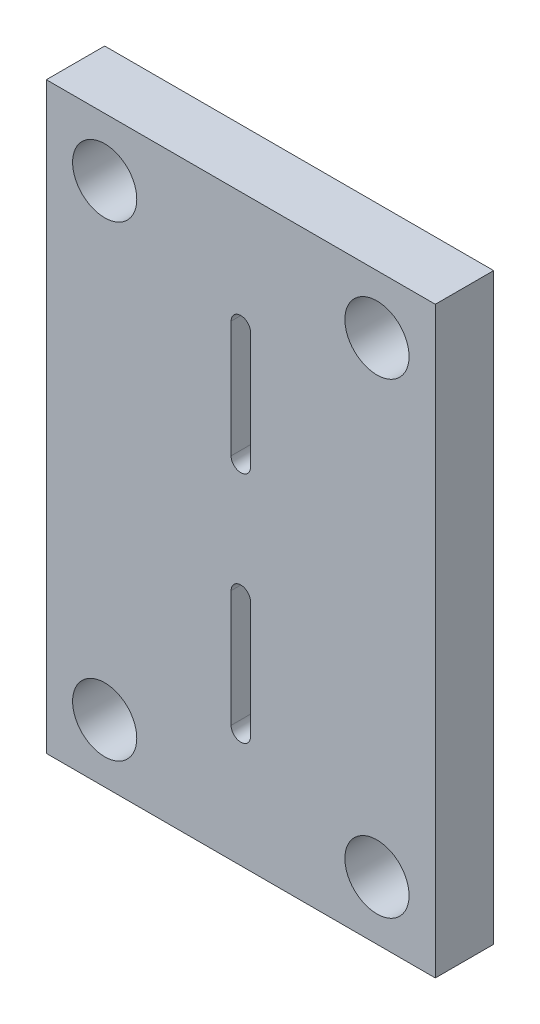
ISO-10303-21;
HEADER;
FILE_DESCRIPTION(('STEP AP214'),'2;1');
FILE_NAME('part.step','',(''),(''),'','','');
FILE_SCHEMA(('AUTOMOTIVE_DESIGN { 1 0 10303 214 1 1 1 1 }'));
ENDSEC;
DATA;
#1=APPLICATION_CONTEXT('core data for automotive mechanical design processes');
#2=APPLICATION_PROTOCOL_DEFINITION('international standard','automotive_design',2000,#1);
#3=PRODUCT_CONTEXT('',#1,'mechanical');
#4=PRODUCT('Part','Part','',(#3));
#5=PRODUCT_RELATED_PRODUCT_CATEGORY('part','',(#4));
#6=PRODUCT_DEFINITION_FORMATION('','',#4);
#7=PRODUCT_DEFINITION_CONTEXT('part definition',#1,'design');
#8=PRODUCT_DEFINITION('design','',#6,#7);
#9=PRODUCT_DEFINITION_SHAPE('','',#8);
#10=(LENGTH_UNIT() NAMED_UNIT(*) SI_UNIT(.MILLI.,.METRE.));
#11=(NAMED_UNIT(*) PLANE_ANGLE_UNIT() SI_UNIT($,.RADIAN.));
#12=(NAMED_UNIT(*) SI_UNIT($,.STERADIAN.) SOLID_ANGLE_UNIT());
#13=UNCERTAINTY_MEASURE_WITH_UNIT(LENGTH_MEASURE(1.E-05),#10,'distance_accuracy_value','');
#14=(GEOMETRIC_REPRESENTATION_CONTEXT(3) GLOBAL_UNCERTAINTY_ASSIGNED_CONTEXT((#13)) GLOBAL_UNIT_ASSIGNED_CONTEXT((#10,
#11,#12)) REPRESENTATION_CONTEXT('',''));
#15=CARTESIAN_POINT('',(0.,0.,0.));
#16=DIRECTION('',(0.,0.,1.));
#17=DIRECTION('',(1.,0.,0.));
#18=AXIS2_PLACEMENT_3D('',#15,#16,#17);
#19=CARTESIAN_POINT('',(0.,0.,3.));
#20=DIRECTION('',(0.,0.,1.));
#21=DIRECTION('',(1.,0.,0.));
#22=AXIS2_PLACEMENT_3D('',#19,#20,#21);
#23=PLANE('',#22);
#24=CARTESIAN_POINT('',(0.,3.,3.));
#25=DIRECTION('',(0.,0.,1.));
#26=DIRECTION('',(1.,0.,0.));
#27=AXIS2_PLACEMENT_3D('',#24,#25,#26);
#28=CIRCLE('',#27,0.5);
#29=CARTESIAN_POINT('',(-0.5,3.,3.));
#30=VERTEX_POINT('',#29);
#31=CARTESIAN_POINT('',(0.5,3.,3.));
#32=VERTEX_POINT('',#31);
#33=EDGE_CURVE('E48',#30,#32,#28,.T.);
#34=ORIENTED_EDGE('',*,*,#33,.F.);
#35=DIRECTION('',(0.,-1.,0.));
#36=VECTOR('',#35,1.);
#37=CARTESIAN_POINT('',(-0.5,3.,3.));
#38=LINE('',#37,#36);
#39=CARTESIAN_POINT('',(-0.5,9.,3.));
#40=VERTEX_POINT('',#39);
#41=EDGE_CURVE('E130',#40,#30,#38,.T.);
#42=ORIENTED_EDGE('',*,*,#41,.F.);
#43=CARTESIAN_POINT('',(0.,9.,3.));
#44=DIRECTION('',(0.,0.,1.));
#45=DIRECTION('',(1.,0.,0.));
#46=AXIS2_PLACEMENT_3D('',#43,#44,#45);
#47=CIRCLE('',#46,0.5);
#48=CARTESIAN_POINT('',(0.5,9.,3.));
#49=VERTEX_POINT('',#48);
#50=EDGE_CURVE('E150',#49,#40,#47,.T.);
#51=ORIENTED_EDGE('',*,*,#50,.F.);
#52=DIRECTION('',(0.,1.,0.));
#53=VECTOR('',#52,1.);
#54=CARTESIAN_POINT('',(0.5,3.,3.));
#55=LINE('',#54,#53);
#56=EDGE_CURVE('E144',#32,#49,#55,.T.);
#57=ORIENTED_EDGE('',*,*,#56,.F.);
#58=EDGE_LOOP('',(#34,#42,#51,#57));
#59=FACE_BOUND('',#58,.T.);
#60=CARTESIAN_POINT('',(0.,-9.,3.));
#61=DIRECTION('',(0.,0.,1.));
#62=DIRECTION('',(1.,0.,0.));
#63=AXIS2_PLACEMENT_3D('',#60,#61,#62);
#64=CIRCLE('',#63,0.5);
#65=CARTESIAN_POINT('',(-0.5,-9.,3.));
#66=VERTEX_POINT('',#65);
#67=CARTESIAN_POINT('',(0.5,-9.,3.));
#68=VERTEX_POINT('',#67);
#69=EDGE_CURVE('E166',#66,#68,#64,.T.);
#70=ORIENTED_EDGE('',*,*,#69,.F.);
#71=DIRECTION('',(0.,-1.,0.));
#72=VECTOR('',#71,1.);
#73=CARTESIAN_POINT('',(-0.5,-9.,3.));
#74=LINE('',#73,#72);
#75=CARTESIAN_POINT('',(-0.5,-3.,3.));
#76=VERTEX_POINT('',#75);
#77=EDGE_CURVE('E174',#76,#66,#74,.T.);
#78=ORIENTED_EDGE('',*,*,#77,.F.);
#79=CARTESIAN_POINT('',(0.,-3.,3.));
#80=DIRECTION('',(0.,0.,1.));
#81=DIRECTION('',(1.,0.,0.));
#82=AXIS2_PLACEMENT_3D('',#79,#80,#81);
#83=CIRCLE('',#82,0.5);
#84=CARTESIAN_POINT('',(0.5,-3.,3.));
#85=VERTEX_POINT('',#84);
#86=EDGE_CURVE('E171',#85,#76,#83,.T.);
#87=ORIENTED_EDGE('',*,*,#86,.F.);
#88=DIRECTION('',(0.,1.,0.));
#89=VECTOR('',#88,1.);
#90=CARTESIAN_POINT('',(0.5,-9.,3.));
#91=LINE('',#90,#89);
#92=EDGE_CURVE('E168',#68,#85,#91,.T.);
#93=ORIENTED_EDGE('',*,*,#92,.F.);
#94=EDGE_LOOP('',(#70,#78,#87,#93));
#95=FACE_BOUND('',#94,.T.);
#96=CARTESIAN_POINT('',(7.,-12.,3.));
#97=DIRECTION('',(0.,0.,1.));
#98=DIRECTION('',(1.,0.,0.));
#99=AXIS2_PLACEMENT_3D('',#96,#97,#98);
#100=CIRCLE('',#99,1.65);
#101=CARTESIAN_POINT('',(8.65,-12.,3.));
#102=VERTEX_POINT('',#101);
#103=EDGE_CURVE('E196',#102,#102,#100,.T.);
#104=ORIENTED_EDGE('',*,*,#103,.F.);
#105=EDGE_LOOP('',(#104));
#106=FACE_BOUND('',#105,.T.);
#107=CARTESIAN_POINT('',(-7.,12.,3.));
#108=DIRECTION('',(0.,0.,1.));
#109=DIRECTION('',(1.,0.,0.));
#110=AXIS2_PLACEMENT_3D('',#107,#108,#109);
#111=CIRCLE('',#110,1.65);
#112=CARTESIAN_POINT('',(-5.35,12.,3.));
#113=VERTEX_POINT('',#112);
#114=EDGE_CURVE('E208',#113,#113,#111,.T.);
#115=ORIENTED_EDGE('',*,*,#114,.F.);
#116=EDGE_LOOP('',(#115));
#117=FACE_BOUND('',#116,.T.);
#118=DIRECTION('',(0.,-1.,0.));
#119=VECTOR('',#118,1.);
#120=CARTESIAN_POINT('',(-10.,-15.,3.));
#121=LINE('',#120,#119);
#122=CARTESIAN_POINT('',(-10.,15.,3.));
#123=VERTEX_POINT('',#122);
#124=CARTESIAN_POINT('',(-10.,-15.,3.));
#125=VERTEX_POINT('',#124);
#126=EDGE_CURVE('E214',#123,#125,#121,.T.);
#127=ORIENTED_EDGE('',*,*,#126,.T.);
#128=DIRECTION('',(1.,0.,0.));
#129=VECTOR('',#128,1.);
#130=CARTESIAN_POINT('',(10.,-15.,3.));
#131=LINE('',#130,#129);
#132=CARTESIAN_POINT('',(10.,-15.,3.));
#133=VERTEX_POINT('',#132);
#134=EDGE_CURVE('E217',#125,#133,#131,.T.);
#135=ORIENTED_EDGE('',*,*,#134,.T.);
#136=DIRECTION('',(0.,1.,0.));
#137=VECTOR('',#136,1.);
#138=CARTESIAN_POINT('',(10.,-15.,3.));
#139=LINE('',#138,#137);
#140=CARTESIAN_POINT('',(10.,15.,3.));
#141=VERTEX_POINT('',#140);
#142=EDGE_CURVE('E220',#133,#141,#139,.T.);
#143=ORIENTED_EDGE('',*,*,#142,.T.);
#144=DIRECTION('',(-1.,0.,0.));
#145=VECTOR('',#144,1.);
#146=CARTESIAN_POINT('',(10.,15.,3.));
#147=LINE('',#146,#145);
#148=EDGE_CURVE('E222',#141,#123,#147,.T.);
#149=ORIENTED_EDGE('',*,*,#148,.T.);
#150=EDGE_LOOP('',(#127,#135,#143,#149));
#151=FACE_BOUND('',#150,.T.);
#152=CARTESIAN_POINT('',(7.,12.,3.));
#153=DIRECTION('',(0.,0.,1.));
#154=DIRECTION('',(1.,0.,0.));
#155=AXIS2_PLACEMENT_3D('',#152,#153,#154);
#156=CIRCLE('',#155,1.65);
#157=CARTESIAN_POINT('',(8.65,12.,3.));
#158=VERTEX_POINT('',#157);
#159=EDGE_CURVE('E202',#158,#158,#156,.T.);
#160=ORIENTED_EDGE('',*,*,#159,.F.);
#161=EDGE_LOOP('',(#160));
#162=FACE_BOUND('',#161,.T.);
#163=CARTESIAN_POINT('',(-7.,-12.,3.));
#164=DIRECTION('',(0.,0.,1.));
#165=DIRECTION('',(1.,0.,0.));
#166=AXIS2_PLACEMENT_3D('',#163,#164,#165);
#167=CIRCLE('',#166,1.65);
#168=CARTESIAN_POINT('',(-5.35,-12.,3.));
#169=VERTEX_POINT('',#168);
#170=EDGE_CURVE('E190',#169,#169,#167,.T.);
#171=ORIENTED_EDGE('',*,*,#170,.F.);
#172=EDGE_LOOP('',(#171));
#173=FACE_BOUND('',#172,.T.);
#174=ADVANCED_FACE('F33',(#59,#95,#106,#117,#151,#162,#173),#23,.T.);
#175=CARTESIAN_POINT('',(0.,0.,0.));
#176=DIRECTION('',(0.,0.,1.));
#177=DIRECTION('',(1.,0.,0.));
#178=AXIS2_PLACEMENT_3D('',#175,#176,#177);
#179=PLANE('',#178);
#180=DIRECTION('',(0.,1.,0.));
#181=VECTOR('',#180,1.);
#182=CARTESIAN_POINT('',(-0.5,3.,0.));
#183=LINE('',#182,#181);
#184=CARTESIAN_POINT('',(-0.5,3.,0.));
#185=VERTEX_POINT('',#184);
#186=CARTESIAN_POINT('',(-0.5,9.,0.));
#187=VERTEX_POINT('',#186);
#188=EDGE_CURVE('E142',#185,#187,#183,.T.);
#189=ORIENTED_EDGE('',*,*,#188,.F.);
#190=CARTESIAN_POINT('',(0.,3.,0.));
#191=DIRECTION('',(0.,0.,1.));
#192=DIRECTION('',(1.,0.,0.));
#193=AXIS2_PLACEMENT_3D('',#190,#191,#192);
#194=CIRCLE('',#193,0.5);
#195=CARTESIAN_POINT('',(0.5,3.,0.));
#196=VERTEX_POINT('',#195);
#197=EDGE_CURVE('E124',#196,#185,#194,.F.);
#198=ORIENTED_EDGE('',*,*,#197,.F.);
#199=DIRECTION('',(0.,-1.,0.));
#200=VECTOR('',#199,1.);
#201=CARTESIAN_POINT('',(0.5,3.,0.));
#202=LINE('',#201,#200);
#203=CARTESIAN_POINT('',(0.5,9.,0.));
#204=VERTEX_POINT('',#203);
#205=EDGE_CURVE('E133',#204,#196,#202,.T.);
#206=ORIENTED_EDGE('',*,*,#205,.F.);
#207=CARTESIAN_POINT('',(0.,9.,0.));
#208=DIRECTION('',(0.,0.,1.));
#209=DIRECTION('',(1.,0.,0.));
#210=AXIS2_PLACEMENT_3D('',#207,#208,#209);
#211=CIRCLE('',#210,0.5);
#212=EDGE_CURVE('E56',#187,#204,#211,.F.);
#213=ORIENTED_EDGE('',*,*,#212,.F.);
#214=EDGE_LOOP('',(#189,#198,#206,#213));
#215=FACE_BOUND('',#214,.T.);
#216=DIRECTION('',(0.,1.,0.));
#217=VECTOR('',#216,1.);
#218=CARTESIAN_POINT('',(-0.5,-9.,0.));
#219=LINE('',#218,#217);
#220=CARTESIAN_POINT('',(-0.5,-9.,0.));
#221=VERTEX_POINT('',#220);
#222=CARTESIAN_POINT('',(-0.5,-3.,0.));
#223=VERTEX_POINT('',#222);
#224=EDGE_CURVE('E160',#221,#223,#219,.T.);
#225=ORIENTED_EDGE('',*,*,#224,.F.);
#226=CARTESIAN_POINT('',(0.,-9.,0.));
#227=DIRECTION('',(0.,0.,1.));
#228=DIRECTION('',(1.,0.,0.));
#229=AXIS2_PLACEMENT_3D('',#226,#227,#228);
#230=CIRCLE('',#229,0.5);
#231=CARTESIAN_POINT('',(0.5,-9.,0.));
#232=VERTEX_POINT('',#231);
#233=EDGE_CURVE('E163',#232,#221,#230,.F.);
#234=ORIENTED_EDGE('',*,*,#233,.F.);
#235=DIRECTION('',(0.,-1.,0.));
#236=VECTOR('',#235,1.);
#237=CARTESIAN_POINT('',(0.5,-9.,0.));
#238=LINE('',#237,#236);
#239=CARTESIAN_POINT('',(0.5,-3.,0.));
#240=VERTEX_POINT('',#239);
#241=EDGE_CURVE('E180',#240,#232,#238,.T.);
#242=ORIENTED_EDGE('',*,*,#241,.F.);
#243=CARTESIAN_POINT('',(0.,-3.,0.));
#244=DIRECTION('',(0.,0.,1.));
#245=DIRECTION('',(1.,0.,0.));
#246=AXIS2_PLACEMENT_3D('',#243,#244,#245);
#247=CIRCLE('',#246,0.5);
#248=EDGE_CURVE('E136',#223,#240,#247,.F.);
#249=ORIENTED_EDGE('',*,*,#248,.F.);
#250=EDGE_LOOP('',(#225,#234,#242,#249));
#251=FACE_BOUND('',#250,.T.);
#252=CARTESIAN_POINT('',(7.,-12.,0.));
#253=DIRECTION('',(0.,0.,1.));
#254=DIRECTION('',(1.,0.,0.));
#255=AXIS2_PLACEMENT_3D('',#252,#253,#254);
#256=CIRCLE('',#255,1.65);
#257=CARTESIAN_POINT('',(8.65,-12.,0.));
#258=VERTEX_POINT('',#257);
#259=EDGE_CURVE('E193',#258,#258,#256,.T.);
#260=ORIENTED_EDGE('',*,*,#259,.T.);
#261=EDGE_LOOP('',(#260));
#262=FACE_BOUND('',#261,.T.);
#263=CARTESIAN_POINT('',(-7.,12.,0.));
#264=DIRECTION('',(0.,0.,1.));
#265=DIRECTION('',(1.,0.,0.));
#266=AXIS2_PLACEMENT_3D('',#263,#264,#265);
#267=CIRCLE('',#266,1.65);
#268=CARTESIAN_POINT('',(-5.35,12.,0.));
#269=VERTEX_POINT('',#268);
#270=EDGE_CURVE('E205',#269,#269,#267,.T.);
#271=ORIENTED_EDGE('',*,*,#270,.T.);
#272=EDGE_LOOP('',(#271));
#273=FACE_BOUND('',#272,.T.);
#274=DIRECTION('',(0.,-1.,0.));
#275=VECTOR('',#274,1.);
#276=CARTESIAN_POINT('',(-10.,-15.,0.));
#277=LINE('',#276,#275);
#278=CARTESIAN_POINT('',(-10.,15.,0.));
#279=VERTEX_POINT('',#278);
#280=CARTESIAN_POINT('',(-10.,-15.,0.));
#281=VERTEX_POINT('',#280);
#282=EDGE_CURVE('E211',#279,#281,#277,.T.);
#283=ORIENTED_EDGE('',*,*,#282,.F.);
#284=DIRECTION('',(-1.,0.,0.));
#285=VECTOR('',#284,1.);
#286=CARTESIAN_POINT('',(10.,15.,0.));
#287=LINE('',#286,#285);
#288=CARTESIAN_POINT('',(10.,15.,0.));
#289=VERTEX_POINT('',#288);
#290=EDGE_CURVE('E218',#289,#279,#287,.T.);
#291=ORIENTED_EDGE('',*,*,#290,.F.);
#292=DIRECTION('',(0.,1.,0.));
#293=VECTOR('',#292,1.);
#294=CARTESIAN_POINT('',(10.,-15.,0.));
#295=LINE('',#294,#293);
#296=CARTESIAN_POINT('',(10.,-15.,0.));
#297=VERTEX_POINT('',#296);
#298=EDGE_CURVE('E229',#297,#289,#295,.T.);
#299=ORIENTED_EDGE('',*,*,#298,.F.);
#300=DIRECTION('',(1.,0.,0.));
#301=VECTOR('',#300,1.);
#302=CARTESIAN_POINT('',(10.,-15.,0.));
#303=LINE('',#302,#301);
#304=EDGE_CURVE('E227',#281,#297,#303,.T.);
#305=ORIENTED_EDGE('',*,*,#304,.F.);
#306=EDGE_LOOP('',(#283,#291,#299,#305));
#307=FACE_BOUND('',#306,.T.);
#308=CARTESIAN_POINT('',(7.,12.,0.));
#309=DIRECTION('',(0.,0.,1.));
#310=DIRECTION('',(1.,0.,0.));
#311=AXIS2_PLACEMENT_3D('',#308,#309,#310);
#312=CIRCLE('',#311,1.65);
#313=CARTESIAN_POINT('',(8.65,12.,0.));
#314=VERTEX_POINT('',#313);
#315=EDGE_CURVE('E199',#314,#314,#312,.T.);
#316=ORIENTED_EDGE('',*,*,#315,.T.);
#317=EDGE_LOOP('',(#316));
#318=FACE_BOUND('',#317,.T.);
#319=CARTESIAN_POINT('',(-7.,-12.,0.));
#320=DIRECTION('',(0.,0.,1.));
#321=DIRECTION('',(1.,0.,0.));
#322=AXIS2_PLACEMENT_3D('',#319,#320,#321);
#323=CIRCLE('',#322,1.65);
#324=CARTESIAN_POINT('',(-5.35,-12.,0.));
#325=VERTEX_POINT('',#324);
#326=EDGE_CURVE('E189',#325,#325,#323,.T.);
#327=ORIENTED_EDGE('',*,*,#326,.T.);
#328=EDGE_LOOP('',(#327));
#329=FACE_BOUND('',#328,.T.);
#330=ADVANCED_FACE('F139',(#215,#251,#262,#273,#307,#318,#329),#179,.F.);
#331=CARTESIAN_POINT('',(-10.,-15.,3.));
#332=DIRECTION('',(1.,0.,0.));
#333=DIRECTION('',(0.,0.,-1.));
#334=AXIS2_PLACEMENT_3D('',#331,#332,#333);
#335=PLANE('',#334);
#336=ORIENTED_EDGE('',*,*,#282,.T.);
#337=DIRECTION('',(0.,0.,-1.));
#338=VECTOR('',#337,1.);
#339=CARTESIAN_POINT('',(-10.,-15.,3.));
#340=LINE('',#339,#338);
#341=EDGE_CURVE('E11',#125,#281,#340,.T.);
#342=ORIENTED_EDGE('',*,*,#341,.F.);
#343=ORIENTED_EDGE('',*,*,#126,.F.);
#344=DIRECTION('',(0.,0.,-1.));
#345=VECTOR('',#344,1.);
#346=CARTESIAN_POINT('',(-10.,15.,3.));
#347=LINE('',#346,#345);
#348=EDGE_CURVE('E224',#123,#279,#347,.T.);
#349=ORIENTED_EDGE('',*,*,#348,.T.);
#350=EDGE_LOOP('',(#336,#342,#343,#349));
#351=FACE_BOUND('',#350,.T.);
#352=ADVANCED_FACE('F35',(#351),#335,.F.);
#353=CARTESIAN_POINT('',(10.,-15.,3.));
#354=DIRECTION('',(0.,1.,0.));
#355=DIRECTION('',(-1.,0.,0.));
#356=AXIS2_PLACEMENT_3D('',#353,#354,#355);
#357=PLANE('',#356);
#358=ORIENTED_EDGE('',*,*,#304,.T.);
#359=DIRECTION('',(0.,0.,-1.));
#360=VECTOR('',#359,1.);
#361=CARTESIAN_POINT('',(10.,-15.,3.));
#362=LINE('',#361,#360);
#363=EDGE_CURVE('E41',#133,#297,#362,.T.);
#364=ORIENTED_EDGE('',*,*,#363,.F.);
#365=ORIENTED_EDGE('',*,*,#134,.F.);
#366=ORIENTED_EDGE('',*,*,#341,.T.);
#367=EDGE_LOOP('',(#358,#364,#365,#366));
#368=FACE_BOUND('',#367,.T.);
#369=ADVANCED_FACE('F257',(#368),#357,.F.);
#370=CARTESIAN_POINT('',(10.,-15.,3.));
#371=DIRECTION('',(-1.,0.,0.));
#372=DIRECTION('',(0.,0.,1.));
#373=AXIS2_PLACEMENT_3D('',#370,#371,#372);
#374=PLANE('',#373);
#375=ORIENTED_EDGE('',*,*,#298,.T.);
#376=DIRECTION('',(0.,0.,-1.));
#377=VECTOR('',#376,1.);
#378=CARTESIAN_POINT('',(10.,15.,3.));
#379=LINE('',#378,#377);
#380=EDGE_CURVE('E234',#141,#289,#379,.T.);
#381=ORIENTED_EDGE('',*,*,#380,.F.);
#382=ORIENTED_EDGE('',*,*,#142,.F.);
#383=ORIENTED_EDGE('',*,*,#363,.T.);
#384=EDGE_LOOP('',(#375,#381,#382,#383));
#385=FACE_BOUND('',#384,.T.);
#386=ADVANCED_FACE('F241',(#385),#374,.F.);
#387=CARTESIAN_POINT('',(10.,15.,3.));
#388=DIRECTION('',(0.,-1.,0.));
#389=DIRECTION('',(1.,0.,0.));
#390=AXIS2_PLACEMENT_3D('',#387,#388,#389);
#391=PLANE('',#390);
#392=ORIENTED_EDGE('',*,*,#290,.T.);
#393=ORIENTED_EDGE('',*,*,#348,.F.);
#394=ORIENTED_EDGE('',*,*,#148,.F.);
#395=ORIENTED_EDGE('',*,*,#380,.T.);
#396=EDGE_LOOP('',(#392,#393,#394,#395));
#397=FACE_BOUND('',#396,.T.);
#398=ADVANCED_FACE('F250',(#397),#391,.F.);
#399=CARTESIAN_POINT('',(-7.,12.,3.));
#400=DIRECTION('',(0.,0.,-1.));
#401=DIRECTION('',(-1.,0.,0.));
#402=AXIS2_PLACEMENT_3D('',#399,#400,#401);
#403=CYLINDRICAL_SURFACE('',#402,1.65);
#404=ORIENTED_EDGE('',*,*,#114,.T.);
#405=EDGE_LOOP('',(#404));
#406=FACE_BOUND('',#405,.T.);
#407=ORIENTED_EDGE('',*,*,#270,.F.);
#408=EDGE_LOOP('',(#407));
#409=FACE_BOUND('',#408,.T.);
#410=ADVANCED_FACE('F273',(#406,#409),#403,.F.);
#411=CARTESIAN_POINT('',(7.,12.,3.));
#412=DIRECTION('',(0.,0.,-1.));
#413=DIRECTION('',(-1.,0.,0.));
#414=AXIS2_PLACEMENT_3D('',#411,#412,#413);
#415=CYLINDRICAL_SURFACE('',#414,1.65);
#416=ORIENTED_EDGE('',*,*,#159,.T.);
#417=EDGE_LOOP('',(#416));
#418=FACE_BOUND('',#417,.T.);
#419=ORIENTED_EDGE('',*,*,#315,.F.);
#420=EDGE_LOOP('',(#419));
#421=FACE_BOUND('',#420,.T.);
#422=ADVANCED_FACE('F280',(#418,#421),#415,.F.);
#423=CARTESIAN_POINT('',(7.,-12.,3.));
#424=DIRECTION('',(0.,0.,-1.));
#425=DIRECTION('',(-1.,0.,0.));
#426=AXIS2_PLACEMENT_3D('',#423,#424,#425);
#427=CYLINDRICAL_SURFACE('',#426,1.65);
#428=ORIENTED_EDGE('',*,*,#103,.T.);
#429=EDGE_LOOP('',(#428));
#430=FACE_BOUND('',#429,.T.);
#431=ORIENTED_EDGE('',*,*,#259,.F.);
#432=EDGE_LOOP('',(#431));
#433=FACE_BOUND('',#432,.T.);
#434=ADVANCED_FACE('F285',(#430,#433),#427,.F.);
#435=CARTESIAN_POINT('',(-7.,-12.,3.));
#436=DIRECTION('',(0.,0.,-1.));
#437=DIRECTION('',(-1.,0.,0.));
#438=AXIS2_PLACEMENT_3D('',#435,#436,#437);
#439=CYLINDRICAL_SURFACE('',#438,1.65);
#440=ORIENTED_EDGE('',*,*,#170,.T.);
#441=EDGE_LOOP('',(#440));
#442=FACE_BOUND('',#441,.T.);
#443=ORIENTED_EDGE('',*,*,#326,.F.);
#444=EDGE_LOOP('',(#443));
#445=FACE_BOUND('',#444,.T.);
#446=ADVANCED_FACE('F295',(#442,#445),#439,.F.);
#447=CARTESIAN_POINT('',(0.,-9.,-0.00100000000000013));
#448=DIRECTION('',(0.,0.,1.));
#449=DIRECTION('',(1.,0.,0.));
#450=AXIS2_PLACEMENT_3D('',#447,#448,#449);
#451=CYLINDRICAL_SURFACE('',#450,0.5);
#452=ORIENTED_EDGE('',*,*,#233,.T.);
#453=DIRECTION('',(0.,0.,1.));
#454=VECTOR('',#453,1.);
#455=CARTESIAN_POINT('',(-0.5,-9.,-0.00100000000000013));
#456=LINE('',#455,#454);
#457=EDGE_CURVE('E178',#221,#66,#456,.T.);
#458=ORIENTED_EDGE('',*,*,#457,.T.);
#459=ORIENTED_EDGE('',*,*,#69,.T.);
#460=DIRECTION('',(0.,0.,1.));
#461=VECTOR('',#460,1.);
#462=CARTESIAN_POINT('',(0.5,-9.,-0.00100000000000013));
#463=LINE('',#462,#461);
#464=EDGE_CURVE('E177',#232,#68,#463,.T.);
#465=ORIENTED_EDGE('',*,*,#464,.F.);
#466=EDGE_LOOP('',(#452,#458,#459,#465));
#467=FACE_BOUND('',#466,.T.);
#468=ADVANCED_FACE('F302',(#467),#451,.F.);
#469=CARTESIAN_POINT('',(-0.5,-9.,-0.00100000000000013));
#470=DIRECTION('',(-1.,0.,0.));
#471=DIRECTION('',(0.,0.,1.));
#472=AXIS2_PLACEMENT_3D('',#469,#470,#471);
#473=PLANE('',#472);
#474=ORIENTED_EDGE('',*,*,#224,.T.);
#475=DIRECTION('',(0.,0.,1.));
#476=VECTOR('',#475,1.);
#477=CARTESIAN_POINT('',(-0.5,-3.,-0.00100000000000013));
#478=LINE('',#477,#476);
#479=EDGE_CURVE('E181',#223,#76,#478,.T.);
#480=ORIENTED_EDGE('',*,*,#479,.T.);
#481=ORIENTED_EDGE('',*,*,#77,.T.);
#482=ORIENTED_EDGE('',*,*,#457,.F.);
#483=EDGE_LOOP('',(#474,#480,#481,#482));
#484=FACE_BOUND('',#483,.T.);
#485=ADVANCED_FACE('F306',(#484),#473,.F.);
#486=CARTESIAN_POINT('',(0.,-3.,-0.00100000000000013));
#487=DIRECTION('',(0.,0.,1.));
#488=DIRECTION('',(1.,0.,0.));
#489=AXIS2_PLACEMENT_3D('',#486,#487,#488);
#490=CYLINDRICAL_SURFACE('',#489,0.5);
#491=ORIENTED_EDGE('',*,*,#248,.T.);
#492=DIRECTION('',(0.,0.,1.));
#493=VECTOR('',#492,1.);
#494=CARTESIAN_POINT('',(0.5,-3.,-0.00100000000000013));
#495=LINE('',#494,#493);
#496=EDGE_CURVE('E183',#240,#85,#495,.T.);
#497=ORIENTED_EDGE('',*,*,#496,.T.);
#498=ORIENTED_EDGE('',*,*,#86,.T.);
#499=ORIENTED_EDGE('',*,*,#479,.F.);
#500=EDGE_LOOP('',(#491,#497,#498,#499));
#501=FACE_BOUND('',#500,.T.);
#502=ADVANCED_FACE('F311',(#501),#490,.F.);
#503=CARTESIAN_POINT('',(0.5,-9.,-0.00100000000000013));
#504=DIRECTION('',(1.,0.,0.));
#505=DIRECTION('',(0.,0.,-1.));
#506=AXIS2_PLACEMENT_3D('',#503,#504,#505);
#507=PLANE('',#506);
#508=ORIENTED_EDGE('',*,*,#241,.T.);
#509=ORIENTED_EDGE('',*,*,#464,.T.);
#510=ORIENTED_EDGE('',*,*,#92,.T.);
#511=ORIENTED_EDGE('',*,*,#496,.F.);
#512=EDGE_LOOP('',(#508,#509,#510,#511));
#513=FACE_BOUND('',#512,.T.);
#514=ADVANCED_FACE('F308',(#513),#507,.F.);
#515=CARTESIAN_POINT('',(0.,3.,-0.00100000000000013));
#516=DIRECTION('',(0.,0.,1.));
#517=DIRECTION('',(1.,0.,0.));
#518=AXIS2_PLACEMENT_3D('',#515,#516,#517);
#519=CYLINDRICAL_SURFACE('',#518,0.5);
#520=ORIENTED_EDGE('',*,*,#197,.T.);
#521=DIRECTION('',(0.,0.,1.));
#522=VECTOR('',#521,1.);
#523=CARTESIAN_POINT('',(-0.5,3.,-0.00100000000000013));
#524=LINE('',#523,#522);
#525=EDGE_CURVE('E137',#185,#30,#524,.T.);
#526=ORIENTED_EDGE('',*,*,#525,.T.);
#527=ORIENTED_EDGE('',*,*,#33,.T.);
#528=DIRECTION('',(0.,0.,1.));
#529=VECTOR('',#528,1.);
#530=CARTESIAN_POINT('',(0.5,3.,-0.00100000000000013));
#531=LINE('',#530,#529);
#532=EDGE_CURVE('E120',#196,#32,#531,.T.);
#533=ORIENTED_EDGE('',*,*,#532,.F.);
#534=EDGE_LOOP('',(#520,#526,#527,#533));
#535=FACE_BOUND('',#534,.T.);
#536=ADVANCED_FACE('F122',(#535),#519,.F.);
#537=CARTESIAN_POINT('',(-0.5,3.,-0.00100000000000013));
#538=DIRECTION('',(-1.,0.,0.));
#539=DIRECTION('',(0.,0.,1.));
#540=AXIS2_PLACEMENT_3D('',#537,#538,#539);
#541=PLANE('',#540);
#542=ORIENTED_EDGE('',*,*,#188,.T.);
#543=DIRECTION('',(0.,0.,1.));
#544=VECTOR('',#543,1.);
#545=CARTESIAN_POINT('',(-0.5,9.,-0.00100000000000013));
#546=LINE('',#545,#544);
#547=EDGE_CURVE('E156',#187,#40,#546,.T.);
#548=ORIENTED_EDGE('',*,*,#547,.T.);
#549=ORIENTED_EDGE('',*,*,#41,.T.);
#550=ORIENTED_EDGE('',*,*,#525,.F.);
#551=EDGE_LOOP('',(#542,#548,#549,#550));
#552=FACE_BOUND('',#551,.T.);
#553=ADVANCED_FACE('F321',(#552),#541,.F.);
#554=CARTESIAN_POINT('',(0.,9.,-0.00100000000000013));
#555=DIRECTION('',(0.,0.,1.));
#556=DIRECTION('',(1.,0.,0.));
#557=AXIS2_PLACEMENT_3D('',#554,#555,#556);
#558=CYLINDRICAL_SURFACE('',#557,0.5);
#559=ORIENTED_EDGE('',*,*,#212,.T.);
#560=DIRECTION('',(0.,0.,1.));
#561=VECTOR('',#560,1.);
#562=CARTESIAN_POINT('',(0.5,9.,-0.00100000000000013));
#563=LINE('',#562,#561);
#564=EDGE_CURVE('E129',#204,#49,#563,.T.);
#565=ORIENTED_EDGE('',*,*,#564,.T.);
#566=ORIENTED_EDGE('',*,*,#50,.T.);
#567=ORIENTED_EDGE('',*,*,#547,.F.);
#568=EDGE_LOOP('',(#559,#565,#566,#567));
#569=FACE_BOUND('',#568,.T.);
#570=ADVANCED_FACE('F324',(#569),#558,.F.);
#571=CARTESIAN_POINT('',(0.5,3.,-0.00100000000000013));
#572=DIRECTION('',(1.,0.,0.));
#573=DIRECTION('',(0.,0.,-1.));
#574=AXIS2_PLACEMENT_3D('',#571,#572,#573);
#575=PLANE('',#574);
#576=ORIENTED_EDGE('',*,*,#205,.T.);
#577=ORIENTED_EDGE('',*,*,#532,.T.);
#578=ORIENTED_EDGE('',*,*,#56,.T.);
#579=ORIENTED_EDGE('',*,*,#564,.F.);
#580=EDGE_LOOP('',(#576,#577,#578,#579));
#581=FACE_BOUND('',#580,.T.);
#582=ADVANCED_FACE('F134',(#581),#575,.F.);
#583=CLOSED_SHELL('',(#174,#330,#352,#369,#386,#398,#410,#422,#434,#446,#468,#485,#502,#514,
#536,#553,#570,#582));
#584=MANIFOLD_SOLID_BREP('B2',#583);
#585=ADVANCED_BREP_SHAPE_REPRESENTATION('',(#18,#584),#14);
#586=SHAPE_DEFINITION_REPRESENTATION(#9,#585);
ENDSEC;
END-ISO-10303-21;
